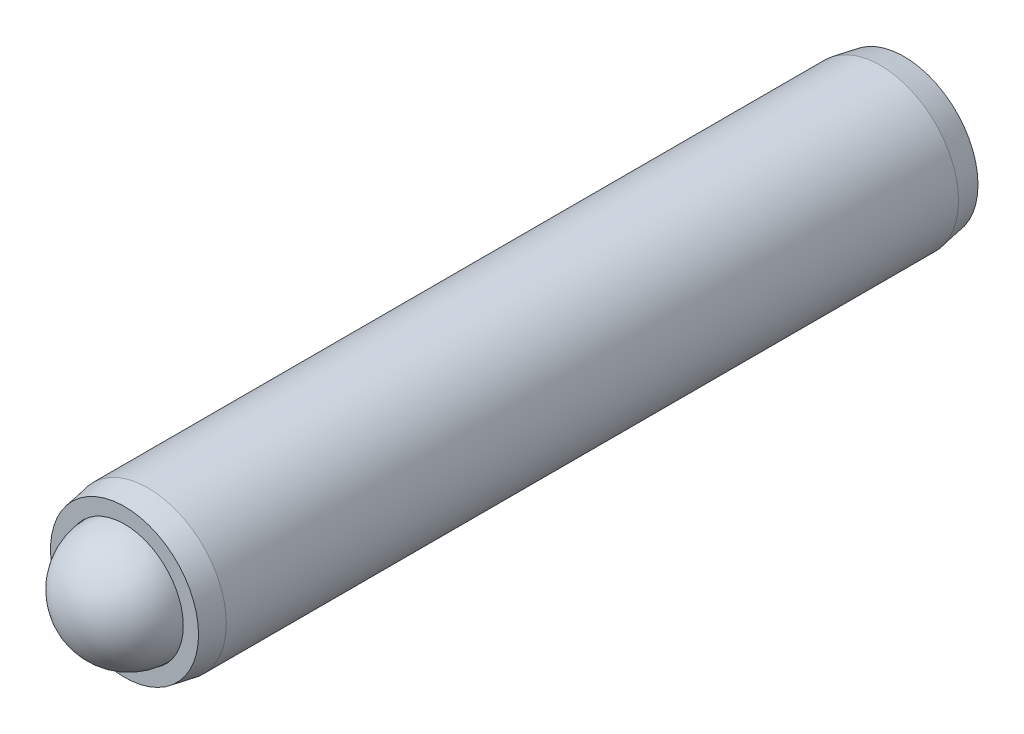
ISO-10303-21;
HEADER;
FILE_DESCRIPTION(('STEP AP214'),'2;1');
FILE_NAME('part.step','',(''),(''),'','','');
FILE_SCHEMA(('AUTOMOTIVE_DESIGN { 1 0 10303 214 1 1 1 1 }'));
ENDSEC;
DATA;
#1=APPLICATION_CONTEXT('core data for automotive mechanical design processes');
#2=APPLICATION_PROTOCOL_DEFINITION('international standard','automotive_design',2000,#1);
#3=PRODUCT_CONTEXT('',#1,'mechanical');
#4=PRODUCT('Part','Part','',(#3));
#5=PRODUCT_RELATED_PRODUCT_CATEGORY('part','',(#4));
#6=PRODUCT_DEFINITION_FORMATION('','',#4);
#7=PRODUCT_DEFINITION_CONTEXT('part definition',#1,'design');
#8=PRODUCT_DEFINITION('design','',#6,#7);
#9=PRODUCT_DEFINITION_SHAPE('','',#8);
#10=(LENGTH_UNIT() NAMED_UNIT(*) SI_UNIT(.MILLI.,.METRE.));
#11=(NAMED_UNIT(*) PLANE_ANGLE_UNIT() SI_UNIT($,.RADIAN.));
#12=(NAMED_UNIT(*) SI_UNIT($,.STERADIAN.) SOLID_ANGLE_UNIT());
#13=UNCERTAINTY_MEASURE_WITH_UNIT(LENGTH_MEASURE(1.E-05),#10,'distance_accuracy_value','');
#14=(GEOMETRIC_REPRESENTATION_CONTEXT(3) GLOBAL_UNCERTAINTY_ASSIGNED_CONTEXT((#13)) GLOBAL_UNIT_ASSIGNED_CONTEXT((#10,
#11,#12)) REPRESENTATION_CONTEXT('',''));
#15=CARTESIAN_POINT('',(0.,0.,0.));
#16=DIRECTION('',(0.,0.,1.));
#17=DIRECTION('',(1.,0.,0.));
#18=AXIS2_PLACEMENT_3D('',#15,#16,#17);
#19=CARTESIAN_POINT('',(7.19645625906651,5.09346110698061,-30.9989566897064));
#20=DIRECTION('',(0.,0.,1.));
#21=DIRECTION('',(1.,0.,0.));
#22=AXIS2_PLACEMENT_3D('',#19,#20,#21);
#23=CONICAL_SURFACE('',#22,4.5085,0.174532925199426);
#24=CARTESIAN_POINT('',(7.19645625906651,5.09346110698061,-29.5584511075234));
#25=DIRECTION('',(0.,0.,1.));
#26=DIRECTION('',(1.,0.,0.));
#27=AXIS2_PLACEMENT_3D('',#24,#25,#26);
#28=CIRCLE('',#27,4.7625);
#29=CARTESIAN_POINT('',(11.9589562590665,5.09346110698061,-29.5584511075234));
#30=VERTEX_POINT('',#29);
#31=EDGE_CURVE('P0_E150',#30,#30,#28,.T.);
#32=ORIENTED_EDGE('',*,*,#31,.F.);
#33=EDGE_LOOP('',(#32));
#34=FACE_BOUND('',#33,.T.);
#35=CARTESIAN_POINT('',(7.19645625906651,5.09346110698061,-30.9989566897064));
#36=DIRECTION('',(0.,0.,1.));
#37=DIRECTION('',(1.,0.,0.));
#38=AXIS2_PLACEMENT_3D('',#35,#36,#37);
#39=CIRCLE('',#38,4.5085);
#40=CARTESIAN_POINT('',(11.7049562590665,5.09346110698061,-30.9989566897064));
#41=VERTEX_POINT('',#40);
#42=EDGE_CURVE('P0_E126',#41,#41,#39,.T.);
#43=ORIENTED_EDGE('',*,*,#42,.T.);
#44=EDGE_LOOP('',(#43));
#45=FACE_BOUND('',#44,.T.);
#46=ADVANCED_FACE('P0_F16',(#34,#45),#23,.T.);
#47=CARTESIAN_POINT('',(7.19645625906651,5.09346110698061,11.1777742421922));
#48=DIRECTION('',(0.,0.,1.));
#49=DIRECTION('',(1.,0.,0.));
#50=AXIS2_PLACEMENT_3D('',#47,#48,#49);
#51=CYLINDRICAL_SURFACE('',#50,4.7625);
#52=CARTESIAN_POINT('',(7.19645625906651,5.09346110698061,15.0426627281108));
#53=DIRECTION('',(0.,0.,1.));
#54=DIRECTION('',(1.,0.,0.));
#55=AXIS2_PLACEMENT_3D('',#52,#53,#54);
#56=CIRCLE('',#55,4.7625);
#57=CARTESIAN_POINT('',(11.9589562590665,5.09346110698061,15.0426627281108));
#58=VERTEX_POINT('',#57);
#59=EDGE_CURVE('P0_E147',#58,#58,#56,.T.);
#60=ORIENTED_EDGE('',*,*,#59,.F.);
#61=EDGE_LOOP('',(#60));
#62=FACE_BOUND('',#61,.T.);
#63=ORIENTED_EDGE('',*,*,#31,.T.);
#64=EDGE_LOOP('',(#63));
#65=FACE_BOUND('',#64,.T.);
#66=ADVANCED_FACE('P0_F219',(#62,#65),#51,.T.);
#67=CARTESIAN_POINT('',(7.19645625906651,5.09346110698061,15.0426627281108));
#68=DIRECTION('',(0.,0.,-1.));
#69=DIRECTION('',(-1.,0.,0.));
#70=AXIS2_PLACEMENT_3D('',#67,#68,#69);
#71=CONICAL_SURFACE('',#70,4.7625,0.174532925199433);
#72=CARTESIAN_POINT('',(7.19645625906651,5.09346110698061,16.4831683102937));
#73=DIRECTION('',(0.,0.,1.));
#74=DIRECTION('',(1.,0.,0.));
#75=AXIS2_PLACEMENT_3D('',#72,#73,#74);
#76=CIRCLE('',#75,4.5085);
#77=CARTESIAN_POINT('',(11.7049562590665,5.09346110698061,16.4831683102937));
#78=VERTEX_POINT('',#77);
#79=EDGE_CURVE('P0_E144',#78,#78,#76,.T.);
#80=ORIENTED_EDGE('',*,*,#79,.F.);
#81=EDGE_LOOP('',(#80));
#82=FACE_BOUND('',#81,.T.);
#83=ORIENTED_EDGE('',*,*,#59,.T.);
#84=EDGE_LOOP('',(#83));
#85=FACE_BOUND('',#84,.T.);
#86=ADVANCED_FACE('P0_F225',(#82,#85),#71,.T.);
#87=CARTESIAN_POINT('',(7.19645625906651,9.60196110698061,16.4831683102937));
#88=DIRECTION('',(0.,0.,-1.));
#89=DIRECTION('',(-1.,0.,0.));
#90=AXIS2_PLACEMENT_3D('',#87,#88,#89);
#91=PLANE('',#90);
#92=CARTESIAN_POINT('',(7.19645625906651,5.09346110698061,16.4831683102936));
#93=DIRECTION('',(0.,0.,1.));
#94=DIRECTION('',(1.,0.,0.));
#95=AXIS2_PLACEMENT_3D('',#92,#93,#94);
#96=CIRCLE('',#95,3.578225);
#97=CARTESIAN_POINT('',(10.7746812590665,5.09346110698061,16.4831683102936));
#98=VERTEX_POINT('',#97);
#99=EDGE_CURVE('P0_E141',#98,#98,#96,.T.);
#100=ORIENTED_EDGE('',*,*,#99,.F.);
#101=EDGE_LOOP('',(#100));
#102=FACE_BOUND('',#101,.T.);
#103=ORIENTED_EDGE('',*,*,#79,.T.);
#104=EDGE_LOOP('',(#103));
#105=FACE_BOUND('',#104,.T.);
#106=ADVANCED_FACE('P0_F362',(#102,#105),#91,.F.);
#107=CARTESIAN_POINT('',(7.19645625906651,5.09346110698061,11.1777742421922));
#108=DIRECTION('',(0.,0.,1.));
#109=DIRECTION('',(1.,0.,0.));
#110=AXIS2_PLACEMENT_3D('',#107,#108,#109);
#111=CYLINDRICAL_SURFACE('',#110,3.578225);
#112=CARTESIAN_POINT('',(7.19645625906651,5.09346110698061,14.7559992421923));
#113=DIRECTION('',(0.,0.,1.));
#114=DIRECTION('',(1.,0.,0.));
#115=AXIS2_PLACEMENT_3D('',#112,#113,#114);
#116=CIRCLE('',#115,3.578225);
#117=CARTESIAN_POINT('',(10.7746812590665,5.09346110698061,14.7559992421923));
#118=VERTEX_POINT('',#117);
#119=EDGE_CURVE('P0_E138',#118,#118,#116,.T.);
#120=ORIENTED_EDGE('',*,*,#119,.F.);
#121=EDGE_LOOP('',(#120));
#122=FACE_BOUND('',#121,.T.);
#123=ORIENTED_EDGE('',*,*,#99,.T.);
#124=EDGE_LOOP('',(#123));
#125=FACE_BOUND('',#124,.T.);
#126=ADVANCED_FACE('P0_F353',(#122,#125),#111,.F.);
#127=CARTESIAN_POINT('',(7.19645625906651,5.09346110698061,14.7559992421923));
#128=DIRECTION('',(0.,0.,1.));
#129=DIRECTION('',(1.,0.,0.));
#130=AXIS2_PLACEMENT_3D('',#127,#128,#129);
#131=CONICAL_SURFACE('',#130,3.578225,0.785398163397436);
#132=CARTESIAN_POINT('',(7.19645625906651,5.09346110698061,11.1777742421922));
#133=VERTEX_POINT('',#132);
#134=VERTEX_LOOP('',#133);
#135=FACE_BOUND('',#134,.T.);
#136=ORIENTED_EDGE('',*,*,#119,.T.);
#137=EDGE_LOOP('',(#136));
#138=FACE_BOUND('',#137,.T.);
#139=ADVANCED_FACE('P0_F344',(#135,#138),#131,.F.);
#140=CARTESIAN_POINT('',(7.19645625906651,9.60196110698061,-30.9989566897064));
#141=DIRECTION('',(0.,0.,1.));
#142=DIRECTION('',(1.,0.,0.));
#143=AXIS2_PLACEMENT_3D('',#140,#141,#142);
#144=PLANE('',#143);
#145=DIRECTION('',(1.,0.,0.));
#146=VECTOR('',#145,1.);
#147=CARTESIAN_POINT('',(7.19645625906651,2.45821110698061,-30.9989566897064));
#148=LINE('',#147,#146);
#149=CARTESIAN_POINT('',(5.67499396218454,2.45821110698061,-30.9989566897064));
#150=VERTEX_POINT('',#149);
#151=CARTESIAN_POINT('',(8.71791855594847,2.45821110698061,-30.9989566897064));
#152=VERTEX_POINT('',#151);
#153=EDGE_CURVE('P0_E164',#150,#152,#148,.T.);
#154=ORIENTED_EDGE('',*,*,#153,.T.);
#155=DIRECTION('',(0.5,0.866025403784439,0.));
#156=VECTOR('',#155,1.);
#157=CARTESIAN_POINT('',(11.4308874708705,7.15721110698061,-30.9989566897064));
#158=LINE('',#157,#156);
#159=CARTESIAN_POINT('',(10.2393808528304,5.09346110698061,-30.9989566897064));
#160=VERTEX_POINT('',#159);
#161=EDGE_CURVE('P0_E166',#152,#160,#158,.T.);
#162=ORIENTED_EDGE('',*,*,#161,.T.);
#163=DIRECTION('',(-0.5,0.866025403784439,0.));
#164=VECTOR('',#163,1.);
#165=CARTESIAN_POINT('',(7.52641193790838,9.79246110698061,-30.9989566897064));
#166=LINE('',#165,#164);
#167=CARTESIAN_POINT('',(8.71791855594847,7.72871110698062,-30.9989566897064));
#168=VERTEX_POINT('',#167);
#169=EDGE_CURVE('P0_E156',#160,#168,#166,.T.);
#170=ORIENTED_EDGE('',*,*,#169,.T.);
#171=DIRECTION('',(-1.,0.,0.));
#172=VECTOR('',#171,1.);
#173=CARTESIAN_POINT('',(7.19645625906651,7.72871110698062,-30.9989566897064));
#174=LINE('',#173,#172);
#175=CARTESIAN_POINT('',(5.67499396218455,7.72871110698062,-30.9989566897064));
#176=VERTEX_POINT('',#175);
#177=EDGE_CURVE('P0_E158',#168,#176,#174,.T.);
#178=ORIENTED_EDGE('',*,*,#177,.T.);
#179=DIRECTION('',(-0.5,-0.866025403784438,0.));
#180=VECTOR('',#179,1.);
#181=CARTESIAN_POINT('',(6.86650058022463,9.79246110698061,-30.9989566897064));
#182=LINE('',#181,#180);
#183=CARTESIAN_POINT('',(4.15353166530258,5.09346110698061,-30.9989566897064));
#184=VERTEX_POINT('',#183);
#185=EDGE_CURVE('P0_E160',#176,#184,#182,.T.);
#186=ORIENTED_EDGE('',*,*,#185,.T.);
#187=DIRECTION('',(0.5,-0.866025403784439,0.));
#188=VECTOR('',#187,1.);
#189=CARTESIAN_POINT('',(2.96202504726249,7.15721110698061,-30.9989566897064));
#190=LINE('',#189,#188);
#191=EDGE_CURVE('P0_E162',#184,#150,#190,.T.);
#192=ORIENTED_EDGE('',*,*,#191,.T.);
#193=EDGE_LOOP('',(#154,#162,#170,#178,#186,#192));
#194=FACE_BOUND('',#193,.T.);
#195=ORIENTED_EDGE('',*,*,#42,.F.);
#196=EDGE_LOOP('',(#195));
#197=FACE_BOUND('',#196,.T.);
#198=ADVANCED_FACE('P0_F336',(#194,#197),#144,.F.);
#199=CARTESIAN_POINT('',(5.82164093055871,2.71221110698061,-25.9189566897063));
#200=DIRECTION('',(-0.866025403784439,-0.5,0.));
#201=DIRECTION('',(0.5,-0.866025403784439,0.));
#202=AXIS2_PLACEMENT_3D('',#199,#200,#201);
#203=PLANE('',#202);
#204=DIRECTION('',(0.,0.,-1.));
#205=VECTOR('',#204,1.);
#206=CARTESIAN_POINT('',(5.82164093055871,2.71221110698061,-25.9189566897063));
#207=LINE('',#206,#205);
#208=CARTESIAN_POINT('',(5.82164093055871,2.71221110698061,-25.9189566897063));
#209=VERTEX_POINT('',#208);
#210=CARTESIAN_POINT('',(5.82164093055871,2.71221110698061,-30.7449566897063));
#211=VERTEX_POINT('',#210);
#212=EDGE_CURVE('P0_E124',#209,#211,#207,.T.);
#213=ORIENTED_EDGE('',*,*,#212,.T.);
#214=DIRECTION('',(-0.5,0.866025403784439,0.));
#215=VECTOR('',#214,1.);
#216=CARTESIAN_POINT('',(5.82164093055871,2.71221110698061,-30.7449566897063));
#217=LINE('',#216,#215);
#218=CARTESIAN_POINT('',(4.44682560205091,5.09346110698061,-30.7449566897063));
#219=VERTEX_POINT('',#218);
#220=EDGE_CURVE('P0_E98',#211,#219,#217,.T.);
#221=ORIENTED_EDGE('',*,*,#220,.T.);
#222=DIRECTION('',(0.,0.,-1.));
#223=VECTOR('',#222,1.);
#224=CARTESIAN_POINT('',(4.44682560205091,5.09346110698061,-25.9189566897063));
#225=LINE('',#224,#223);
#226=CARTESIAN_POINT('',(4.44682560205091,5.09346110698061,-25.9189566897063));
#227=VERTEX_POINT('',#226);
#228=EDGE_CURVE('P0_E90',#227,#219,#225,.T.);
#229=ORIENTED_EDGE('',*,*,#228,.F.);
#230=DIRECTION('',(-0.5,0.866025403784439,0.));
#231=VECTOR('',#230,1.);
#232=CARTESIAN_POINT('',(5.82164093055871,2.71221110698061,-25.9189566897063));
#233=LINE('',#232,#231);
#234=EDGE_CURVE('P0_E95',#209,#227,#233,.T.);
#235=ORIENTED_EDGE('',*,*,#234,.F.);
#236=EDGE_LOOP('',(#213,#221,#229,#235));
#237=FACE_BOUND('',#236,.T.);
#238=ADVANCED_FACE('P0_F93',(#237),#203,.F.);
#239=CARTESIAN_POINT('',(8.5712715875743,2.71221110698061,-25.9189566897063));
#240=DIRECTION('',(0.,-1.,0.));
#241=DIRECTION('',(1.,0.,0.));
#242=AXIS2_PLACEMENT_3D('',#239,#240,#241);
#243=PLANE('',#242);
#244=DIRECTION('',(0.,0.,-1.));
#245=VECTOR('',#244,1.);
#246=CARTESIAN_POINT('',(8.5712715875743,2.71221110698061,-25.9189566897063));
#247=LINE('',#246,#245);
#248=CARTESIAN_POINT('',(8.5712715875743,2.71221110698061,-25.9189566897063));
#249=VERTEX_POINT('',#248);
#250=CARTESIAN_POINT('',(8.5712715875743,2.71221110698061,-30.7449566897063));
#251=VERTEX_POINT('',#250);
#252=EDGE_CURVE('P0_E127',#249,#251,#247,.T.);
#253=ORIENTED_EDGE('',*,*,#252,.T.);
#254=DIRECTION('',(-1.,0.,0.));
#255=VECTOR('',#254,1.);
#256=CARTESIAN_POINT('',(8.5712715875743,2.71221110698061,-30.7449566897063));
#257=LINE('',#256,#255);
#258=EDGE_CURVE('P0_E169',#251,#211,#257,.T.);
#259=ORIENTED_EDGE('',*,*,#258,.T.);
#260=ORIENTED_EDGE('',*,*,#212,.F.);
#261=DIRECTION('',(-1.,0.,0.));
#262=VECTOR('',#261,1.);
#263=CARTESIAN_POINT('',(8.5712715875743,2.71221110698061,-25.9189566897063));
#264=LINE('',#263,#262);
#265=EDGE_CURVE('P0_E100',#249,#209,#264,.T.);
#266=ORIENTED_EDGE('',*,*,#265,.F.);
#267=EDGE_LOOP('',(#253,#259,#260,#266));
#268=FACE_BOUND('',#267,.T.);
#269=ADVANCED_FACE('P0_F254',(#268),#243,.F.);
#270=CARTESIAN_POINT('',(9.9460869160821,5.09346110698061,-25.9189566897063));
#271=DIRECTION('',(0.866025403784438,-0.5,0.));
#272=DIRECTION('',(0.5,0.866025403784438,0.));
#273=AXIS2_PLACEMENT_3D('',#270,#271,#272);
#274=PLANE('',#273);
#275=DIRECTION('',(0.,0.,-1.));
#276=VECTOR('',#275,1.);
#277=CARTESIAN_POINT('',(9.9460869160821,5.09346110698061,-25.9189566897063));
#278=LINE('',#277,#276);
#279=CARTESIAN_POINT('',(9.9460869160821,5.09346110698061,-25.9189566897063));
#280=VERTEX_POINT('',#279);
#281=CARTESIAN_POINT('',(9.9460869160821,5.09346110698061,-30.7449566897063));
#282=VERTEX_POINT('',#281);
#283=EDGE_CURVE('P0_E130',#280,#282,#278,.T.);
#284=ORIENTED_EDGE('',*,*,#283,.T.);
#285=DIRECTION('',(-0.5,-0.866025403784438,0.));
#286=VECTOR('',#285,1.);
#287=CARTESIAN_POINT('',(9.9460869160821,5.09346110698061,-30.7449566897063));
#288=LINE('',#287,#286);
#289=EDGE_CURVE('P0_E153',#282,#251,#288,.T.);
#290=ORIENTED_EDGE('',*,*,#289,.T.);
#291=ORIENTED_EDGE('',*,*,#252,.F.);
#292=DIRECTION('',(-0.5,-0.866025403784438,0.));
#293=VECTOR('',#292,1.);
#294=CARTESIAN_POINT('',(9.9460869160821,5.09346110698061,-25.9189566897063));
#295=LINE('',#294,#293);
#296=EDGE_CURVE('P0_E121',#280,#249,#295,.T.);
#297=ORIENTED_EDGE('',*,*,#296,.F.);
#298=EDGE_LOOP('',(#284,#290,#291,#297));
#299=FACE_BOUND('',#298,.T.);
#300=ADVANCED_FACE('P0_F207',(#299),#274,.F.);
#301=CARTESIAN_POINT('',(8.57127158757431,7.47471110698061,-25.9189566897063));
#302=DIRECTION('',(0.866025403784438,0.5,0.));
#303=DIRECTION('',(-0.5,0.866025403784439,0.));
#304=AXIS2_PLACEMENT_3D('',#301,#302,#303);
#305=PLANE('',#304);
#306=DIRECTION('',(0.,0.,-1.));
#307=VECTOR('',#306,1.);
#308=CARTESIAN_POINT('',(8.57127158757431,7.47471110698061,-25.9189566897063));
#309=LINE('',#308,#307);
#310=CARTESIAN_POINT('',(8.57127158757431,7.47471110698061,-25.9189566897063));
#311=VERTEX_POINT('',#310);
#312=CARTESIAN_POINT('',(8.57127158757431,7.47471110698061,-30.7449566897063));
#313=VERTEX_POINT('',#312);
#314=EDGE_CURVE('P0_E133',#311,#313,#309,.T.);
#315=ORIENTED_EDGE('',*,*,#314,.T.);
#316=DIRECTION('',(0.5,-0.866025403784439,0.));
#317=VECTOR('',#316,1.);
#318=CARTESIAN_POINT('',(8.57127158757431,7.47471110698061,-30.7449566897063));
#319=LINE('',#318,#317);
#320=EDGE_CURVE('P0_E11',#313,#282,#319,.T.);
#321=ORIENTED_EDGE('',*,*,#320,.T.);
#322=ORIENTED_EDGE('',*,*,#283,.F.);
#323=DIRECTION('',(0.5,-0.866025403784439,0.));
#324=VECTOR('',#323,1.);
#325=CARTESIAN_POINT('',(8.57127158757431,7.47471110698061,-25.9189566897063));
#326=LINE('',#325,#324);
#327=EDGE_CURVE('P0_E118',#311,#280,#326,.T.);
#328=ORIENTED_EDGE('',*,*,#327,.F.);
#329=EDGE_LOOP('',(#315,#321,#322,#328));
#330=FACE_BOUND('',#329,.T.);
#331=ADVANCED_FACE('P0_F203',(#330),#305,.F.);
#332=CARTESIAN_POINT('',(5.82164093055871,7.47471110698061,-25.9189566897063));
#333=DIRECTION('',(0.,1.,0.));
#334=DIRECTION('',(0.,0.,1.));
#335=AXIS2_PLACEMENT_3D('',#332,#333,#334);
#336=PLANE('',#335);
#337=DIRECTION('',(0.,0.,-1.));
#338=VECTOR('',#337,1.);
#339=CARTESIAN_POINT('',(5.82164093055871,7.47471110698061,-25.9189566897063));
#340=LINE('',#339,#338);
#341=CARTESIAN_POINT('',(5.82164093055871,7.47471110698061,-25.9189566897063));
#342=VERTEX_POINT('',#341);
#343=CARTESIAN_POINT('',(5.82164093055871,7.47471110698061,-30.7449566897063));
#344=VERTEX_POINT('',#343);
#345=EDGE_CURVE('P0_E99',#342,#344,#340,.T.);
#346=ORIENTED_EDGE('',*,*,#345,.T.);
#347=DIRECTION('',(1.,0.,0.));
#348=VECTOR('',#347,1.);
#349=CARTESIAN_POINT('',(5.82164093055871,7.47471110698061,-30.7449566897063));
#350=LINE('',#349,#348);
#351=EDGE_CURVE('P0_E25',#344,#313,#350,.T.);
#352=ORIENTED_EDGE('',*,*,#351,.T.);
#353=ORIENTED_EDGE('',*,*,#314,.F.);
#354=DIRECTION('',(1.,0.,0.));
#355=VECTOR('',#354,1.);
#356=CARTESIAN_POINT('',(5.82164093055871,7.47471110698061,-25.9189566897063));
#357=LINE('',#356,#355);
#358=EDGE_CURVE('P0_E108',#342,#311,#357,.T.);
#359=ORIENTED_EDGE('',*,*,#358,.F.);
#360=EDGE_LOOP('',(#346,#352,#353,#359));
#361=FACE_BOUND('',#360,.T.);
#362=ADVANCED_FACE('P0_F208',(#361),#336,.F.);
#363=CARTESIAN_POINT('',(4.44682560205091,5.09346110698061,-25.9189566897063));
#364=DIRECTION('',(-0.866025403784438,0.5,0.));
#365=DIRECTION('',(-0.5,-0.866025403784438,0.));
#366=AXIS2_PLACEMENT_3D('',#363,#364,#365);
#367=PLANE('',#366);
#368=ORIENTED_EDGE('',*,*,#228,.T.);
#369=DIRECTION('',(0.5,0.866025403784438,0.));
#370=VECTOR('',#369,1.);
#371=CARTESIAN_POINT('',(4.44682560205091,5.09346110698061,-30.7449566897063));
#372=LINE('',#371,#370);
#373=EDGE_CURVE('P0_E40',#219,#344,#372,.T.);
#374=ORIENTED_EDGE('',*,*,#373,.T.);
#375=ORIENTED_EDGE('',*,*,#345,.F.);
#376=DIRECTION('',(0.5,0.866025403784438,0.));
#377=VECTOR('',#376,1.);
#378=CARTESIAN_POINT('',(4.44682560205091,5.09346110698061,-25.9189566897063));
#379=LINE('',#378,#377);
#380=EDGE_CURVE('P0_E103',#227,#342,#379,.T.);
#381=ORIENTED_EDGE('',*,*,#380,.F.);
#382=EDGE_LOOP('',(#368,#374,#375,#381));
#383=FACE_BOUND('',#382,.T.);
#384=ADVANCED_FACE('P0_F104',(#383),#367,.F.);
#385=CARTESIAN_POINT('',(7.19645625906651,5.09346110698061,-25.9189566897063));
#386=DIRECTION('',(0.,0.,-1.));
#387=DIRECTION('',(0.,1.,0.));
#388=AXIS2_PLACEMENT_3D('',#385,#386,#387);
#389=PLANE('',#388);
#390=ORIENTED_EDGE('',*,*,#234,.T.);
#391=ORIENTED_EDGE('',*,*,#380,.T.);
#392=ORIENTED_EDGE('',*,*,#358,.T.);
#393=ORIENTED_EDGE('',*,*,#327,.T.);
#394=ORIENTED_EDGE('',*,*,#296,.T.);
#395=ORIENTED_EDGE('',*,*,#265,.T.);
#396=EDGE_LOOP('',(#390,#391,#392,#393,#394,#395));
#397=FACE_BOUND('',#396,.T.);
#398=ADVANCED_FACE('P0_F110',(#397),#389,.T.);
#399=CARTESIAN_POINT('',(4.44682560205091,5.09346110698061,-30.7449566897063));
#400=DIRECTION('',(-0.612372435695793,0.353553390593273,0.707106781186549));
#401=DIRECTION('',(0.5,0.866025403784438,0.));
#402=AXIS2_PLACEMENT_3D('',#399,#400,#401);
#403=PLANE('',#402);
#404=DIRECTION('',(-0.755928946018456,0.,-0.654653670707975));
#405=VECTOR('',#404,1.);
#406=CARTESIAN_POINT('',(5.23243436119823,5.09346110698061,-30.0645995468492));
#407=LINE('',#406,#405);
#408=EDGE_CURVE('P0_E115',#184,#219,#407,.F.);
#409=ORIENTED_EDGE('',*,*,#408,.F.);
#410=ORIENTED_EDGE('',*,*,#185,.F.);
#411=DIRECTION('',(-0.377964473009227,0.65465367070798,-0.654653670707975));
#412=VECTOR('',#411,1.);
#413=CARTESIAN_POINT('',(6.21444531013237,6.79435396412346,-30.0645995468492));
#414=LINE('',#413,#412);
#415=EDGE_CURVE('P0_E20',#344,#176,#414,.T.);
#416=ORIENTED_EDGE('',*,*,#415,.F.);
#417=ORIENTED_EDGE('',*,*,#373,.F.);
#418=EDGE_LOOP('',(#409,#410,#416,#417));
#419=FACE_BOUND('',#418,.T.);
#420=ADVANCED_FACE('P0_F18',(#419),#403,.F.);
#421=CARTESIAN_POINT('',(5.82164093055871,7.47471110698061,-30.7449566897063));
#422=DIRECTION('',(0.,0.707106781186545,0.70710678118655));
#423=DIRECTION('',(1.,0.,0.));
#424=AXIS2_PLACEMENT_3D('',#421,#422,#423);
#425=PLANE('',#424);
#426=ORIENTED_EDGE('',*,*,#415,.T.);
#427=ORIENTED_EDGE('',*,*,#177,.F.);
#428=DIRECTION('',(0.377964473009226,0.65465367070798,-0.654653670707975));
#429=VECTOR('',#428,1.);
#430=CARTESIAN_POINT('',(8.17846720800065,6.79435396412347,-30.0645995468492));
#431=LINE('',#430,#429);
#432=EDGE_CURVE('P0_E181',#313,#168,#431,.T.);
#433=ORIENTED_EDGE('',*,*,#432,.F.);
#434=ORIENTED_EDGE('',*,*,#351,.F.);
#435=EDGE_LOOP('',(#426,#427,#433,#434));
#436=FACE_BOUND('',#435,.T.);
#437=ADVANCED_FACE('P0_F195',(#436),#425,.F.);
#438=CARTESIAN_POINT('',(5.82164093055871,2.71221110698061,-30.7449566897063));
#439=DIRECTION('',(-0.612372435695793,-0.353553390593273,0.707106781186549));
#440=DIRECTION('',(-0.5,0.866025403784439,0.));
#441=AXIS2_PLACEMENT_3D('',#438,#439,#440);
#442=PLANE('',#441);
#443=ORIENTED_EDGE('',*,*,#408,.T.);
#444=ORIENTED_EDGE('',*,*,#220,.F.);
#445=DIRECTION('',(-0.377964473009229,-0.654653670707977,-0.654653670707976));
#446=VECTOR('',#445,1.);
#447=CARTESIAN_POINT('',(6.21444531013237,3.39256824983776,-30.0645995468492));
#448=LINE('',#447,#446);
#449=EDGE_CURVE('P0_E178',#150,#211,#448,.F.);
#450=ORIENTED_EDGE('',*,*,#449,.F.);
#451=ORIENTED_EDGE('',*,*,#191,.F.);
#452=EDGE_LOOP('',(#443,#444,#450,#451));
#453=FACE_BOUND('',#452,.T.);
#454=ADVANCED_FACE('P0_F187',(#453),#442,.F.);
#455=CARTESIAN_POINT('',(8.57127158757431,7.47471110698061,-30.7449566897063));
#456=DIRECTION('',(0.612372435695794,0.353553390593273,0.707106781186549));
#457=DIRECTION('',(0.5,-0.866025403784439,0.));
#458=AXIS2_PLACEMENT_3D('',#455,#456,#457);
#459=PLANE('',#458);
#460=ORIENTED_EDGE('',*,*,#432,.T.);
#461=ORIENTED_EDGE('',*,*,#169,.F.);
#462=DIRECTION('',(-0.755928946018456,0.,0.654653670707976));
#463=VECTOR('',#462,1.);
#464=CARTESIAN_POINT('',(9.9460869160821,5.09346110698061,-30.7449566897063));
#465=LINE('',#464,#463);
#466=EDGE_CURVE('P0_E176',#282,#160,#465,.F.);
#467=ORIENTED_EDGE('',*,*,#466,.F.);
#468=ORIENTED_EDGE('',*,*,#320,.F.);
#469=EDGE_LOOP('',(#460,#461,#467,#468));
#470=FACE_BOUND('',#469,.T.);
#471=ADVANCED_FACE('P0_F200',(#470),#459,.F.);
#472=CARTESIAN_POINT('',(8.5712715875743,2.71221110698061,-30.7449566897063));
#473=DIRECTION('',(0.,-0.707106781186547,0.707106781186548));
#474=DIRECTION('',(-1.,0.,0.));
#475=AXIS2_PLACEMENT_3D('',#472,#473,#474);
#476=PLANE('',#475);
#477=ORIENTED_EDGE('',*,*,#449,.T.);
#478=ORIENTED_EDGE('',*,*,#258,.F.);
#479=DIRECTION('',(0.377964473009228,-0.654653670707978,-0.654653670707976));
#480=VECTOR('',#479,1.);
#481=CARTESIAN_POINT('',(8.17846720800065,3.39256824983776,-30.0645995468492));
#482=LINE('',#481,#480);
#483=EDGE_CURVE('P0_E174',#152,#251,#482,.F.);
#484=ORIENTED_EDGE('',*,*,#483,.F.);
#485=ORIENTED_EDGE('',*,*,#153,.F.);
#486=EDGE_LOOP('',(#477,#478,#484,#485));
#487=FACE_BOUND('',#486,.T.);
#488=ADVANCED_FACE('P0_F235',(#487),#476,.F.);
#489=CARTESIAN_POINT('',(9.9460869160821,5.09346110698061,-30.7449566897063));
#490=DIRECTION('',(0.612372435695793,-0.353553390593273,0.707106781186549));
#491=DIRECTION('',(-0.5,-0.866025403784438,0.));
#492=AXIS2_PLACEMENT_3D('',#489,#490,#491);
#493=PLANE('',#492);
#494=ORIENTED_EDGE('',*,*,#466,.T.);
#495=ORIENTED_EDGE('',*,*,#161,.F.);
#496=ORIENTED_EDGE('',*,*,#483,.T.);
#497=ORIENTED_EDGE('',*,*,#289,.F.);
#498=EDGE_LOOP('',(#494,#495,#496,#497));
#499=FACE_BOUND('',#498,.T.);
#500=ADVANCED_FACE('P0_F232',(#499),#493,.F.);
#501=CLOSED_SHELL('',(#46,#66,#86,#106,#126,#139,#198,#238,#269,#300,#331,#362,#384,#398,#420,
#437,#454,#471,#488,#500));
#502=MANIFOLD_SOLID_BREP('P0_B1',#501);
#503=CARTESIAN_POINT('',(7.1964562590665,5.09346110698061,16.2291683102936));
#504=DIRECTION('',(-0.402600946414471,0.0815630345070076,0.91173458273128));
#505=DIRECTION('',(0.359511112073392,0.930077570087712,0.0755478253524907));
#506=AXIS2_PLACEMENT_3D('',#503,#504,#505);
#507=SPHERICAL_SURFACE('',#506,3.571875);
#508=CARTESIAN_POINT('',(5.75841600359231,5.38479407086033,19.4857702729869));
#509=VERTEX_POINT('',#508);
#510=VERTEX_LOOP('',#509);
#511=FACE_BOUND('',#510,.T.);
#512=ADVANCED_FACE('P1_F11',(#511),#507,.T.);
#513=CLOSED_SHELL('',(#512));
#514=MANIFOLD_SOLID_BREP('P1_B1',#513);
#515=ADVANCED_BREP_SHAPE_REPRESENTATION('',(#18,#502,#514),#14);
#516=SHAPE_DEFINITION_REPRESENTATION(#9,#515);
ENDSEC;
END-ISO-10303-21;
